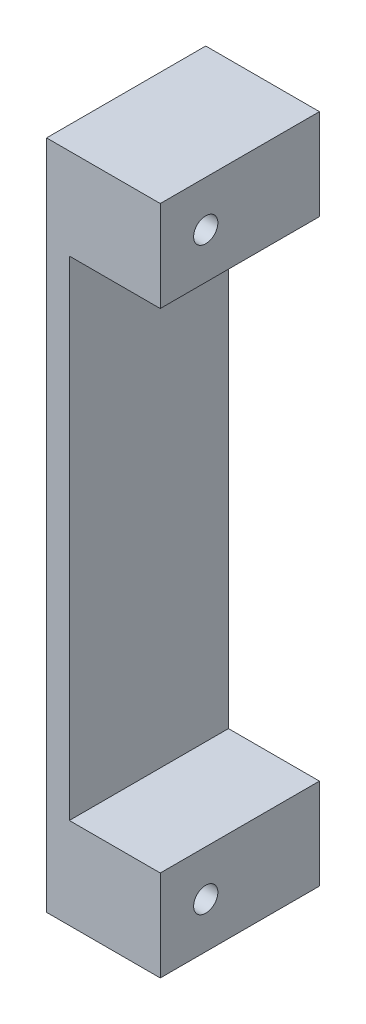
ISO-10303-21;
HEADER;
FILE_DESCRIPTION(('STEP AP214'),'2;1');
FILE_NAME('part.step','',(''),(''),'','','');
FILE_SCHEMA(('AUTOMOTIVE_DESIGN { 1 0 10303 214 1 1 1 1 }'));
ENDSEC;
DATA;
#1=APPLICATION_CONTEXT('core data for automotive mechanical design processes');
#2=APPLICATION_PROTOCOL_DEFINITION('international standard','automotive_design',2000,#1);
#3=PRODUCT_CONTEXT('',#1,'mechanical');
#4=PRODUCT('Part','Part','',(#3));
#5=PRODUCT_RELATED_PRODUCT_CATEGORY('part','',(#4));
#6=PRODUCT_DEFINITION_FORMATION('','',#4);
#7=PRODUCT_DEFINITION_CONTEXT('part definition',#1,'design');
#8=PRODUCT_DEFINITION('design','',#6,#7);
#9=PRODUCT_DEFINITION_SHAPE('','',#8);
#10=(LENGTH_UNIT() NAMED_UNIT(*) SI_UNIT(.MILLI.,.METRE.));
#11=(NAMED_UNIT(*) PLANE_ANGLE_UNIT() SI_UNIT($,.RADIAN.));
#12=(NAMED_UNIT(*) SI_UNIT($,.STERADIAN.) SOLID_ANGLE_UNIT());
#13=UNCERTAINTY_MEASURE_WITH_UNIT(LENGTH_MEASURE(1.E-05),#10,'distance_accuracy_value','');
#14=(GEOMETRIC_REPRESENTATION_CONTEXT(3) GLOBAL_UNCERTAINTY_ASSIGNED_CONTEXT((#13)) GLOBAL_UNIT_ASSIGNED_CONTEXT((#10,
#11,#12)) REPRESENTATION_CONTEXT('',''));
#15=CARTESIAN_POINT('',(0.,0.,0.));
#16=DIRECTION('',(0.,0.,1.));
#17=DIRECTION('',(1.,0.,0.));
#18=AXIS2_PLACEMENT_3D('',#15,#16,#17);
#19=CARTESIAN_POINT('',(12.7,0.,0.));
#20=DIRECTION('',(-1.,0.,0.));
#21=DIRECTION('',(0.,0.,1.));
#22=AXIS2_PLACEMENT_3D('',#19,#20,#21);
#23=PLANE('',#22);
#24=CARTESIAN_POINT('',(12.7,69.85,-5.08));
#25=DIRECTION('',(1.,0.,0.));
#26=DIRECTION('',(0.,0.,-1.));
#27=AXIS2_PLACEMENT_3D('',#24,#25,#26);
#28=CIRCLE('',#27,1.35254999999999);
#29=CARTESIAN_POINT('',(12.7,69.85,-6.43255));
#30=VERTEX_POINT('',#29);
#31=EDGE_CURVE('E178',#30,#30,#28,.T.);
#32=ORIENTED_EDGE('',*,*,#31,.F.);
#33=EDGE_LOOP('',(#32));
#34=FACE_BOUND('',#33,.T.);
#35=DIRECTION('',(0.,-1.,0.));
#36=VECTOR('',#35,1.);
#37=CARTESIAN_POINT('',(12.7,0.,0.));
#38=LINE('',#37,#36);
#39=CARTESIAN_POINT('',(12.7,74.93,0.));
#40=VERTEX_POINT('',#39);
#41=CARTESIAN_POINT('',(12.7,64.77,0.));
#42=VERTEX_POINT('',#41);
#43=EDGE_CURVE('E213',#40,#42,#38,.T.);
#44=ORIENTED_EDGE('',*,*,#43,.T.);
#45=DIRECTION('',(0.,0.,-1.));
#46=VECTOR('',#45,1.);
#47=CARTESIAN_POINT('',(12.7,64.77,0.));
#48=LINE('',#47,#46);
#49=CARTESIAN_POINT('',(12.7,64.77,-17.78));
#50=VERTEX_POINT('',#49);
#51=EDGE_CURVE('E56',#42,#50,#48,.T.);
#52=ORIENTED_EDGE('',*,*,#51,.T.);
#53=DIRECTION('',(0.,1.,0.));
#54=VECTOR('',#53,1.);
#55=CARTESIAN_POINT('',(12.7,0.,-17.78));
#56=LINE('',#55,#54);
#57=CARTESIAN_POINT('',(12.7,74.93,-17.78));
#58=VERTEX_POINT('',#57);
#59=EDGE_CURVE('E219',#50,#58,#56,.T.);
#60=ORIENTED_EDGE('',*,*,#59,.T.);
#61=DIRECTION('',(0.,0.,1.));
#62=VECTOR('',#61,1.);
#63=CARTESIAN_POINT('',(12.7,74.93,0.));
#64=LINE('',#63,#62);
#65=EDGE_CURVE('E223',#58,#40,#64,.T.);
#66=ORIENTED_EDGE('',*,*,#65,.T.);
#67=EDGE_LOOP('',(#44,#52,#60,#66));
#68=FACE_BOUND('',#67,.T.);
#69=ADVANCED_FACE('F48',(#34,#68),#23,.F.);
#70=CARTESIAN_POINT('',(12.7,0.,0.));
#71=DIRECTION('',(0.,0.,-1.));
#72=DIRECTION('',(-1.,0.,0.));
#73=AXIS2_PLACEMENT_3D('',#70,#71,#72);
#74=PLANE('',#73);
#75=DIRECTION('',(0.,-1.,0.));
#76=VECTOR('',#75,1.);
#77=CARTESIAN_POINT('',(2.54,64.77,0.));
#78=LINE('',#77,#76);
#79=CARTESIAN_POINT('',(2.54,64.77,0.));
#80=VERTEX_POINT('',#79);
#81=CARTESIAN_POINT('',(2.54,10.16,0.));
#82=VERTEX_POINT('',#81);
#83=EDGE_CURVE('E193',#80,#82,#78,.T.);
#84=ORIENTED_EDGE('',*,*,#83,.F.);
#85=DIRECTION('',(1.,0.,0.));
#86=VECTOR('',#85,1.);
#87=CARTESIAN_POINT('',(2.54,64.77,0.));
#88=LINE('',#87,#86);
#89=EDGE_CURVE('E202',#80,#42,#88,.T.);
#90=ORIENTED_EDGE('',*,*,#89,.T.);
#91=ORIENTED_EDGE('',*,*,#43,.F.);
#92=DIRECTION('',(-1.,0.,0.));
#93=VECTOR('',#92,1.);
#94=CARTESIAN_POINT('',(12.7,74.93,0.));
#95=LINE('',#94,#93);
#96=CARTESIAN_POINT('',(0.,74.93,0.));
#97=VERTEX_POINT('',#96);
#98=EDGE_CURVE('E225',#40,#97,#95,.T.);
#99=ORIENTED_EDGE('',*,*,#98,.T.);
#100=DIRECTION('',(0.,-1.,0.));
#101=VECTOR('',#100,1.);
#102=CARTESIAN_POINT('',(0.,0.,0.));
#103=LINE('',#102,#101);
#104=CARTESIAN_POINT('',(0.,0.,0.));
#105=VERTEX_POINT('',#104);
#106=EDGE_CURVE('E212',#97,#105,#103,.T.);
#107=ORIENTED_EDGE('',*,*,#106,.T.);
#108=DIRECTION('',(-1.,0.,0.));
#109=VECTOR('',#108,1.);
#110=CARTESIAN_POINT('',(12.7,0.,0.));
#111=LINE('',#110,#109);
#112=CARTESIAN_POINT('',(12.7,0.,0.));
#113=VERTEX_POINT('',#112);
#114=EDGE_CURVE('E242',#113,#105,#111,.T.);
#115=ORIENTED_EDGE('',*,*,#114,.F.);
#116=CARTESIAN_POINT('',(12.7,10.16,0.));
#117=VERTEX_POINT('',#116);
#118=EDGE_CURVE('E217',#117,#113,#38,.T.);
#119=ORIENTED_EDGE('',*,*,#118,.F.);
#120=DIRECTION('',(1.,0.,0.));
#121=VECTOR('',#120,1.);
#122=CARTESIAN_POINT('',(2.54,10.16,0.));
#123=LINE('',#122,#121);
#124=EDGE_CURVE('E71',#82,#117,#123,.T.);
#125=ORIENTED_EDGE('',*,*,#124,.F.);
#126=EDGE_LOOP('',(#84,#90,#91,#99,#107,#115,#119,#125));
#127=FACE_BOUND('',#126,.T.);
#128=ADVANCED_FACE('F50',(#127),#74,.F.);
#129=CARTESIAN_POINT('',(12.7,0.,0.));
#130=DIRECTION('',(0.,1.,0.));
#131=DIRECTION('',(0.,0.,1.));
#132=AXIS2_PLACEMENT_3D('',#129,#130,#131);
#133=PLANE('',#132);
#134=DIRECTION('',(0.,0.,-1.));
#135=VECTOR('',#134,1.);
#136=CARTESIAN_POINT('',(0.,0.,0.));
#137=LINE('',#136,#135);
#138=CARTESIAN_POINT('',(0.,0.,-17.78));
#139=VERTEX_POINT('',#138);
#140=EDGE_CURVE('E228',#105,#139,#137,.T.);
#141=ORIENTED_EDGE('',*,*,#140,.T.);
#142=DIRECTION('',(-1.,0.,0.));
#143=VECTOR('',#142,1.);
#144=CARTESIAN_POINT('',(12.7,0.,-17.78));
#145=LINE('',#144,#143);
#146=CARTESIAN_POINT('',(12.7,0.,-17.78));
#147=VERTEX_POINT('',#146);
#148=EDGE_CURVE('E239',#147,#139,#145,.T.);
#149=ORIENTED_EDGE('',*,*,#148,.F.);
#150=DIRECTION('',(0.,0.,-1.));
#151=VECTOR('',#150,1.);
#152=CARTESIAN_POINT('',(12.7,0.,0.));
#153=LINE('',#152,#151);
#154=EDGE_CURVE('E216',#113,#147,#153,.T.);
#155=ORIENTED_EDGE('',*,*,#154,.F.);
#156=ORIENTED_EDGE('',*,*,#114,.T.);
#157=EDGE_LOOP('',(#141,#149,#155,#156));
#158=FACE_BOUND('',#157,.T.);
#159=ADVANCED_FACE('F275',(#158),#133,.F.);
#160=CARTESIAN_POINT('',(12.7,0.,-17.78));
#161=DIRECTION('',(0.,0.,1.));
#162=DIRECTION('',(1.,0.,0.));
#163=AXIS2_PLACEMENT_3D('',#160,#161,#162);
#164=PLANE('',#163);
#165=DIRECTION('',(0.,1.,0.));
#166=VECTOR('',#165,1.);
#167=CARTESIAN_POINT('',(3.95605,4.953,-17.78));
#168=LINE('',#167,#166);
#169=CARTESIAN_POINT('',(3.95605,4.953,-17.78));
#170=VERTEX_POINT('',#169);
#171=CARTESIAN_POINT('',(3.95605,5.207,-17.78));
#172=VERTEX_POINT('',#171);
#173=EDGE_CURVE('E165',#170,#172,#168,.T.);
#174=ORIENTED_EDGE('',*,*,#173,.F.);
#175=CARTESIAN_POINT('',(6.35,4.953,-17.78));
#176=DIRECTION('',(0.,0.,-1.));
#177=DIRECTION('',(-1.,0.,0.));
#178=AXIS2_PLACEMENT_3D('',#175,#176,#177);
#179=CIRCLE('',#178,2.39395);
#180=CARTESIAN_POINT('',(8.74395,4.953,-17.78));
#181=VERTEX_POINT('',#180);
#182=EDGE_CURVE('E63',#181,#170,#179,.T.);
#183=ORIENTED_EDGE('',*,*,#182,.F.);
#184=DIRECTION('',(0.,-1.,0.));
#185=VECTOR('',#184,1.);
#186=CARTESIAN_POINT('',(8.74395,4.953,-17.78));
#187=LINE('',#186,#185);
#188=CARTESIAN_POINT('',(8.74395,5.207,-17.78));
#189=VERTEX_POINT('',#188);
#190=EDGE_CURVE('E156',#189,#181,#187,.T.);
#191=ORIENTED_EDGE('',*,*,#190,.F.);
#192=CARTESIAN_POINT('',(6.35,5.207,-17.78));
#193=DIRECTION('',(0.,0.,-1.));
#194=DIRECTION('',(-1.,0.,0.));
#195=AXIS2_PLACEMENT_3D('',#192,#193,#194);
#196=CIRCLE('',#195,2.39395);
#197=EDGE_CURVE('E159',#172,#189,#196,.T.);
#198=ORIENTED_EDGE('',*,*,#197,.F.);
#199=EDGE_LOOP('',(#174,#183,#191,#198));
#200=FACE_BOUND('',#199,.T.);
#201=CARTESIAN_POINT('',(6.35,69.85,-17.78));
#202=DIRECTION('',(0.,0.,-1.));
#203=DIRECTION('',(-1.,0.,0.));
#204=AXIS2_PLACEMENT_3D('',#201,#202,#203);
#205=CIRCLE('',#204,2.39395);
#206=CARTESIAN_POINT('',(3.95605,69.85,-17.78));
#207=VERTEX_POINT('',#206);
#208=EDGE_CURVE('E171',#207,#207,#205,.T.);
#209=ORIENTED_EDGE('',*,*,#208,.F.);
#210=EDGE_LOOP('',(#209));
#211=FACE_BOUND('',#210,.T.);
#212=ORIENTED_EDGE('',*,*,#59,.F.);
#213=DIRECTION('',(-1.,0.,0.));
#214=VECTOR('',#213,1.);
#215=CARTESIAN_POINT('',(12.7,64.77,-17.78));
#216=LINE('',#215,#214);
#217=CARTESIAN_POINT('',(2.54,64.77,-17.78));
#218=VERTEX_POINT('',#217);
#219=EDGE_CURVE('E209',#50,#218,#216,.T.);
#220=ORIENTED_EDGE('',*,*,#219,.T.);
#221=DIRECTION('',(0.,1.,0.));
#222=VECTOR('',#221,1.);
#223=CARTESIAN_POINT('',(2.54,0.,-17.78));
#224=LINE('',#223,#222);
#225=CARTESIAN_POINT('',(2.54,10.16,-17.78));
#226=VERTEX_POINT('',#225);
#227=EDGE_CURVE('E13',#226,#218,#224,.T.);
#228=ORIENTED_EDGE('',*,*,#227,.F.);
#229=DIRECTION('',(1.,0.,0.));
#230=VECTOR('',#229,1.);
#231=CARTESIAN_POINT('',(12.7,10.16,-17.78));
#232=LINE('',#231,#230);
#233=CARTESIAN_POINT('',(12.7,10.16,-17.78));
#234=VERTEX_POINT('',#233);
#235=EDGE_CURVE('E205',#226,#234,#232,.T.);
#236=ORIENTED_EDGE('',*,*,#235,.T.);
#237=EDGE_CURVE('E220',#147,#234,#56,.T.);
#238=ORIENTED_EDGE('',*,*,#237,.F.);
#239=ORIENTED_EDGE('',*,*,#148,.T.);
#240=DIRECTION('',(0.,1.,0.));
#241=VECTOR('',#240,1.);
#242=CARTESIAN_POINT('',(0.,0.,-17.78));
#243=LINE('',#242,#241);
#244=CARTESIAN_POINT('',(0.,74.93,-17.78));
#245=VERTEX_POINT('',#244);
#246=EDGE_CURVE('E230',#139,#245,#243,.T.);
#247=ORIENTED_EDGE('',*,*,#246,.T.);
#248=DIRECTION('',(-1.,0.,0.));
#249=VECTOR('',#248,1.);
#250=CARTESIAN_POINT('',(12.7,74.93,-17.78));
#251=LINE('',#250,#249);
#252=EDGE_CURVE('E236',#58,#245,#251,.T.);
#253=ORIENTED_EDGE('',*,*,#252,.F.);
#254=EDGE_LOOP('',(#212,#220,#228,#236,#238,#239,#247,#253));
#255=FACE_BOUND('',#254,.T.);
#256=ADVANCED_FACE('F252',(#200,#211,#255),#164,.F.);
#257=CARTESIAN_POINT('',(12.7,74.93,0.));
#258=DIRECTION('',(0.,-1.,0.));
#259=DIRECTION('',(0.,0.,-1.));
#260=AXIS2_PLACEMENT_3D('',#257,#258,#259);
#261=PLANE('',#260);
#262=DIRECTION('',(0.,0.,1.));
#263=VECTOR('',#262,1.);
#264=CARTESIAN_POINT('',(0.,74.93,0.));
#265=LINE('',#264,#263);
#266=EDGE_CURVE('E232',#245,#97,#265,.T.);
#267=ORIENTED_EDGE('',*,*,#266,.T.);
#268=ORIENTED_EDGE('',*,*,#98,.F.);
#269=ORIENTED_EDGE('',*,*,#65,.F.);
#270=ORIENTED_EDGE('',*,*,#252,.T.);
#271=EDGE_LOOP('',(#267,#268,#269,#270));
#272=FACE_BOUND('',#271,.T.);
#273=ADVANCED_FACE('F259',(#272),#261,.F.);
#274=CARTESIAN_POINT('',(12.7,5.08,-5.08));
#275=DIRECTION('',(1.,0.,0.));
#276=DIRECTION('',(0.,0.,-1.));
#277=AXIS2_PLACEMENT_3D('',#274,#275,#276);
#278=CIRCLE('',#277,1.35255);
#279=CARTESIAN_POINT('',(12.7,5.08,-6.43255));
#280=VERTEX_POINT('',#279);
#281=EDGE_CURVE('E186',#280,#280,#278,.T.);
#282=ORIENTED_EDGE('',*,*,#281,.F.);
#283=EDGE_LOOP('',(#282));
#284=FACE_BOUND('',#283,.T.);
#285=ORIENTED_EDGE('',*,*,#237,.T.);
#286=DIRECTION('',(0.,0.,-1.));
#287=VECTOR('',#286,1.);
#288=CARTESIAN_POINT('',(12.7,10.16,-13.97));
#289=LINE('',#288,#287);
#290=EDGE_CURVE('E192',#117,#234,#289,.T.);
#291=ORIENTED_EDGE('',*,*,#290,.F.);
#292=ORIENTED_EDGE('',*,*,#118,.T.);
#293=ORIENTED_EDGE('',*,*,#154,.T.);
#294=EDGE_LOOP('',(#285,#291,#292,#293));
#295=FACE_BOUND('',#294,.T.);
#296=ADVANCED_FACE('F269',(#284,#295),#23,.F.);
#297=CARTESIAN_POINT('',(0.,0.,0.));
#298=DIRECTION('',(-1.,0.,0.));
#299=DIRECTION('',(0.,0.,1.));
#300=AXIS2_PLACEMENT_3D('',#297,#298,#299);
#301=PLANE('',#300);
#302=CARTESIAN_POINT('',(0.,69.85,-5.08));
#303=DIRECTION('',(1.,0.,0.));
#304=DIRECTION('',(0.,0.,-1.));
#305=AXIS2_PLACEMENT_3D('',#302,#303,#304);
#306=CIRCLE('',#305,1.35254999999999);
#307=CARTESIAN_POINT('',(0.,69.85,-6.43255));
#308=VERTEX_POINT('',#307);
#309=EDGE_CURVE('E183',#308,#308,#306,.T.);
#310=ORIENTED_EDGE('',*,*,#309,.T.);
#311=EDGE_LOOP('',(#310));
#312=FACE_BOUND('',#311,.T.);
#313=CARTESIAN_POINT('',(0.,5.08,-5.08));
#314=DIRECTION('',(1.,0.,0.));
#315=DIRECTION('',(0.,0.,-1.));
#316=AXIS2_PLACEMENT_3D('',#313,#314,#315);
#317=CIRCLE('',#316,1.35255);
#318=CARTESIAN_POINT('',(0.,5.08,-6.43255));
#319=VERTEX_POINT('',#318);
#320=EDGE_CURVE('E189',#319,#319,#317,.T.);
#321=ORIENTED_EDGE('',*,*,#320,.T.);
#322=EDGE_LOOP('',(#321));
#323=FACE_BOUND('',#322,.T.);
#324=ORIENTED_EDGE('',*,*,#106,.F.);
#325=ORIENTED_EDGE('',*,*,#266,.F.);
#326=ORIENTED_EDGE('',*,*,#246,.F.);
#327=ORIENTED_EDGE('',*,*,#140,.F.);
#328=EDGE_LOOP('',(#324,#325,#326,#327));
#329=FACE_BOUND('',#328,.T.);
#330=ADVANCED_FACE('F277',(#312,#323,#329),#301,.T.);
#331=CARTESIAN_POINT('',(2.54,0.,0.));
#332=DIRECTION('',(1.,0.,0.));
#333=DIRECTION('',(0.,0.,-1.));
#334=AXIS2_PLACEMENT_3D('',#331,#332,#333);
#335=PLANE('',#334);
#336=ORIENTED_EDGE('',*,*,#227,.T.);
#337=DIRECTION('',(0.,0.,1.));
#338=VECTOR('',#337,1.);
#339=CARTESIAN_POINT('',(2.54,64.77,-13.97));
#340=LINE('',#339,#338);
#341=EDGE_CURVE('E199',#218,#80,#340,.T.);
#342=ORIENTED_EDGE('',*,*,#341,.T.);
#343=ORIENTED_EDGE('',*,*,#83,.T.);
#344=DIRECTION('',(0.,0.,-1.));
#345=VECTOR('',#344,1.);
#346=CARTESIAN_POINT('',(2.54,10.16,0.));
#347=LINE('',#346,#345);
#348=EDGE_CURVE('E196',#82,#226,#347,.T.);
#349=ORIENTED_EDGE('',*,*,#348,.T.);
#350=EDGE_LOOP('',(#336,#342,#343,#349));
#351=FACE_BOUND('',#350,.T.);
#352=ADVANCED_FACE('F266',(#351),#335,.T.);
#353=CARTESIAN_POINT('',(2.54,64.77,0.));
#354=DIRECTION('',(0.,1.,0.));
#355=DIRECTION('',(0.,0.,1.));
#356=AXIS2_PLACEMENT_3D('',#353,#354,#355);
#357=PLANE('',#356);
#358=ORIENTED_EDGE('',*,*,#51,.F.);
#359=ORIENTED_EDGE('',*,*,#89,.F.);
#360=ORIENTED_EDGE('',*,*,#341,.F.);
#361=ORIENTED_EDGE('',*,*,#219,.F.);
#362=EDGE_LOOP('',(#358,#359,#360,#361));
#363=FACE_BOUND('',#362,.T.);
#364=ADVANCED_FACE('F264',(#363),#357,.F.);
#365=CARTESIAN_POINT('',(2.54,10.16,-13.97));
#366=DIRECTION('',(0.,-1.,0.));
#367=DIRECTION('',(0.,0.,-1.));
#368=AXIS2_PLACEMENT_3D('',#365,#366,#367);
#369=PLANE('',#368);
#370=ORIENTED_EDGE('',*,*,#348,.F.);
#371=ORIENTED_EDGE('',*,*,#124,.T.);
#372=ORIENTED_EDGE('',*,*,#290,.T.);
#373=ORIENTED_EDGE('',*,*,#235,.F.);
#374=EDGE_LOOP('',(#370,#371,#372,#373));
#375=FACE_BOUND('',#374,.T.);
#376=ADVANCED_FACE('F297',(#375),#369,.F.);
#377=CARTESIAN_POINT('',(12.7,5.08,-5.08));
#378=DIRECTION('',(1.,0.,0.));
#379=DIRECTION('',(0.,0.,-1.));
#380=AXIS2_PLACEMENT_3D('',#377,#378,#379);
#381=CYLINDRICAL_SURFACE('',#380,1.35255);
#382=ORIENTED_EDGE('',*,*,#320,.F.);
#383=EDGE_LOOP('',(#382));
#384=FACE_BOUND('',#383,.T.);
#385=ORIENTED_EDGE('',*,*,#281,.T.);
#386=EDGE_LOOP('',(#385));
#387=FACE_BOUND('',#386,.T.);
#388=ADVANCED_FACE('F300',(#384,#387),#381,.F.);
#389=CARTESIAN_POINT('',(12.7,69.85,-5.08));
#390=DIRECTION('',(1.,0.,0.));
#391=DIRECTION('',(0.,0.,-1.));
#392=AXIS2_PLACEMENT_3D('',#389,#390,#391);
#393=CYLINDRICAL_SURFACE('',#392,1.35254999999999);
#394=ORIENTED_EDGE('',*,*,#309,.F.);
#395=EDGE_LOOP('',(#394));
#396=FACE_BOUND('',#395,.T.);
#397=ORIENTED_EDGE('',*,*,#31,.T.);
#398=EDGE_LOOP('',(#397));
#399=FACE_BOUND('',#398,.T.);
#400=ADVANCED_FACE('F305',(#396,#399),#393,.F.);
#401=CARTESIAN_POINT('',(6.35,69.85,-6.6675));
#402=DIRECTION('',(0.,0.,-1.));
#403=DIRECTION('',(-1.,0.,0.));
#404=AXIS2_PLACEMENT_3D('',#401,#402,#403);
#405=CYLINDRICAL_SURFACE('',#404,2.39395);
#406=CARTESIAN_POINT('',(6.35,69.85,-6.6675));
#407=DIRECTION('',(0.,0.,-1.));
#408=DIRECTION('',(-1.,0.,0.));
#409=AXIS2_PLACEMENT_3D('',#406,#407,#408);
#410=CIRCLE('',#409,2.39395);
#411=CARTESIAN_POINT('',(3.95605,69.85,-6.6675));
#412=VERTEX_POINT('',#411);
#413=EDGE_CURVE('E175',#412,#412,#410,.T.);
#414=ORIENTED_EDGE('',*,*,#413,.F.);
#415=EDGE_LOOP('',(#414));
#416=FACE_BOUND('',#415,.T.);
#417=ORIENTED_EDGE('',*,*,#208,.T.);
#418=EDGE_LOOP('',(#417));
#419=FACE_BOUND('',#418,.T.);
#420=ADVANCED_FACE('F309',(#416,#419),#405,.F.);
#421=CARTESIAN_POINT('',(6.35,69.85,-6.6675));
#422=DIRECTION('',(0.,0.,-1.));
#423=DIRECTION('',(-1.,0.,0.));
#424=AXIS2_PLACEMENT_3D('',#421,#422,#423);
#425=PLANE('',#424);
#426=ORIENTED_EDGE('',*,*,#413,.T.);
#427=EDGE_LOOP('',(#426));
#428=FACE_BOUND('',#427,.T.);
#429=ADVANCED_FACE('F313',(#428),#425,.T.);
#430=CARTESIAN_POINT('',(6.35,4.953,-6.6675));
#431=DIRECTION('',(0.,0.,-1.));
#432=DIRECTION('',(-1.,0.,0.));
#433=AXIS2_PLACEMENT_3D('',#430,#431,#432);
#434=CYLINDRICAL_SURFACE('',#433,2.39395);
#435=ORIENTED_EDGE('',*,*,#182,.T.);
#436=DIRECTION('',(0.,0.,-1.));
#437=VECTOR('',#436,1.);
#438=CARTESIAN_POINT('',(3.95605,4.953,-6.6675));
#439=LINE('',#438,#437);
#440=CARTESIAN_POINT('',(3.95605,4.953,-6.6675));
#441=VERTEX_POINT('',#440);
#442=EDGE_CURVE('E134',#441,#170,#439,.T.);
#443=ORIENTED_EDGE('',*,*,#442,.F.);
#444=CARTESIAN_POINT('',(6.35,4.953,-6.6675));
#445=DIRECTION('',(0.,0.,-1.));
#446=DIRECTION('',(-1.,0.,0.));
#447=AXIS2_PLACEMENT_3D('',#444,#445,#446);
#448=CIRCLE('',#447,2.39395);
#449=CARTESIAN_POINT('',(8.74395,4.953,-6.6675));
#450=VERTEX_POINT('',#449);
#451=EDGE_CURVE('E138',#450,#441,#448,.T.);
#452=ORIENTED_EDGE('',*,*,#451,.F.);
#453=DIRECTION('',(0.,0.,-1.));
#454=VECTOR('',#453,1.);
#455=CARTESIAN_POINT('',(8.74395,4.953,-6.6675));
#456=LINE('',#455,#454);
#457=EDGE_CURVE('E169',#450,#181,#456,.T.);
#458=ORIENTED_EDGE('',*,*,#457,.T.);
#459=EDGE_LOOP('',(#435,#443,#452,#458));
#460=FACE_BOUND('',#459,.T.);
#461=ADVANCED_FACE('F136',(#460),#434,.F.);
#462=CARTESIAN_POINT('',(8.74395,4.953,-6.6675));
#463=DIRECTION('',(1.,0.,0.));
#464=DIRECTION('',(0.,0.,-1.));
#465=AXIS2_PLACEMENT_3D('',#462,#463,#464);
#466=PLANE('',#465);
#467=ORIENTED_EDGE('',*,*,#190,.T.);
#468=ORIENTED_EDGE('',*,*,#457,.F.);
#469=DIRECTION('',(0.,-1.,0.));
#470=VECTOR('',#469,1.);
#471=CARTESIAN_POINT('',(8.74395,4.953,-6.6675));
#472=LINE('',#471,#470);
#473=CARTESIAN_POINT('',(8.74395,5.207,-6.6675));
#474=VERTEX_POINT('',#473);
#475=EDGE_CURVE('E144',#474,#450,#472,.T.);
#476=ORIENTED_EDGE('',*,*,#475,.F.);
#477=DIRECTION('',(0.,0.,-1.));
#478=VECTOR('',#477,1.);
#479=CARTESIAN_POINT('',(8.74395,5.207,-6.6675));
#480=LINE('',#479,#478);
#481=EDGE_CURVE('E172',#474,#189,#480,.T.);
#482=ORIENTED_EDGE('',*,*,#481,.T.);
#483=EDGE_LOOP('',(#467,#468,#476,#482));
#484=FACE_BOUND('',#483,.T.);
#485=ADVANCED_FACE('F320',(#484),#466,.F.);
#486=CARTESIAN_POINT('',(6.35,5.207,-6.6675));
#487=DIRECTION('',(0.,0.,-1.));
#488=DIRECTION('',(-1.,0.,0.));
#489=AXIS2_PLACEMENT_3D('',#486,#487,#488);
#490=CYLINDRICAL_SURFACE('',#489,2.39395);
#491=ORIENTED_EDGE('',*,*,#197,.T.);
#492=ORIENTED_EDGE('',*,*,#481,.F.);
#493=CARTESIAN_POINT('',(6.35,5.207,-6.6675));
#494=DIRECTION('',(0.,0.,-1.));
#495=DIRECTION('',(-1.,0.,0.));
#496=AXIS2_PLACEMENT_3D('',#493,#494,#495);
#497=CIRCLE('',#496,2.39395);
#498=CARTESIAN_POINT('',(3.95605,5.207,-6.6675));
#499=VERTEX_POINT('',#498);
#500=EDGE_CURVE('E152',#499,#474,#497,.T.);
#501=ORIENTED_EDGE('',*,*,#500,.F.);
#502=DIRECTION('',(0.,0.,-1.));
#503=VECTOR('',#502,1.);
#504=CARTESIAN_POINT('',(3.95605,5.207,-6.6675));
#505=LINE('',#504,#503);
#506=EDGE_CURVE('E143',#499,#172,#505,.T.);
#507=ORIENTED_EDGE('',*,*,#506,.T.);
#508=EDGE_LOOP('',(#491,#492,#501,#507));
#509=FACE_BOUND('',#508,.T.);
#510=ADVANCED_FACE('F323',(#509),#490,.F.);
#511=CARTESIAN_POINT('',(3.95605,4.953,-6.6675));
#512=DIRECTION('',(-1.,0.,0.));
#513=DIRECTION('',(0.,0.,1.));
#514=AXIS2_PLACEMENT_3D('',#511,#512,#513);
#515=PLANE('',#514);
#516=ORIENTED_EDGE('',*,*,#173,.T.);
#517=ORIENTED_EDGE('',*,*,#506,.F.);
#518=DIRECTION('',(0.,1.,0.));
#519=VECTOR('',#518,1.);
#520=CARTESIAN_POINT('',(3.95605,4.953,-6.6675));
#521=LINE('',#520,#519);
#522=EDGE_CURVE('E147',#441,#499,#521,.T.);
#523=ORIENTED_EDGE('',*,*,#522,.F.);
#524=ORIENTED_EDGE('',*,*,#442,.T.);
#525=EDGE_LOOP('',(#516,#517,#523,#524));
#526=FACE_BOUND('',#525,.T.);
#527=ADVANCED_FACE('F148',(#526),#515,.F.);
#528=CARTESIAN_POINT('',(6.35,4.953,-6.6675));
#529=DIRECTION('',(0.,0.,-1.));
#530=DIRECTION('',(-1.,0.,0.));
#531=AXIS2_PLACEMENT_3D('',#528,#529,#530);
#532=PLANE('',#531);
#533=ORIENTED_EDGE('',*,*,#451,.T.);
#534=ORIENTED_EDGE('',*,*,#522,.T.);
#535=ORIENTED_EDGE('',*,*,#500,.T.);
#536=ORIENTED_EDGE('',*,*,#475,.T.);
#537=EDGE_LOOP('',(#533,#534,#535,#536));
#538=FACE_BOUND('',#537,.T.);
#539=ADVANCED_FACE('F154',(#538),#532,.T.);
#540=CLOSED_SHELL('',(#69,#128,#159,#256,#273,#296,#330,#352,#364,#376,#388,#400,#420,#429,#461,
#485,#510,#527,#539));
#541=MANIFOLD_SOLID_BREP('B2',#540);
#542=ADVANCED_BREP_SHAPE_REPRESENTATION('',(#18,#541),#14);
#543=SHAPE_DEFINITION_REPRESENTATION(#9,#542);
ENDSEC;
END-ISO-10303-21;
